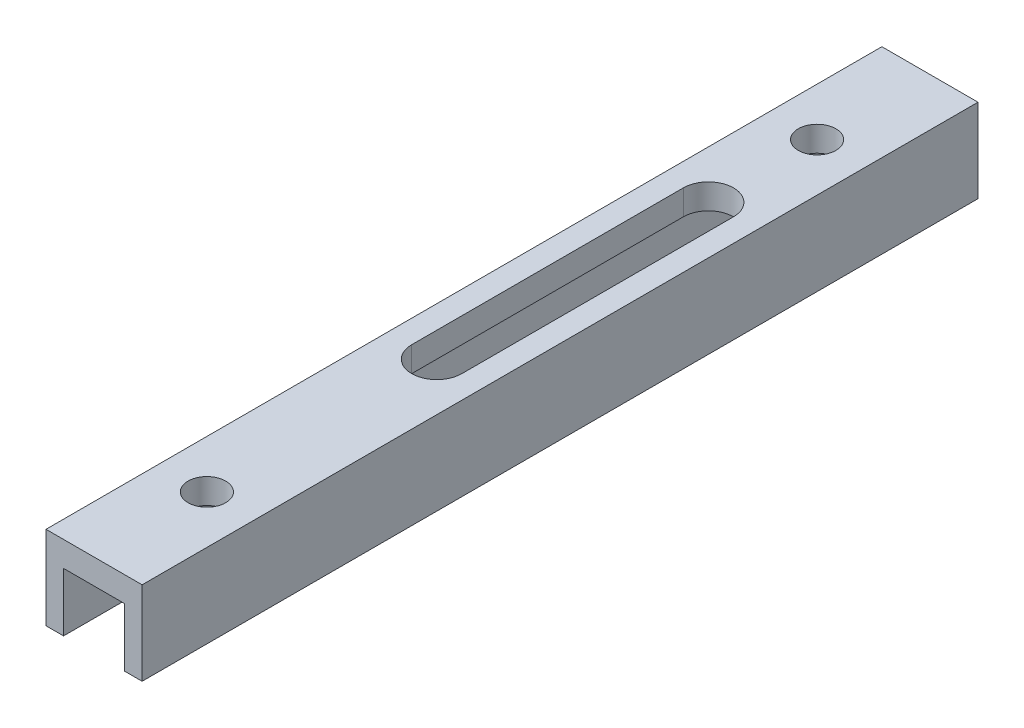
ISO-10303-21;
HEADER;
FILE_DESCRIPTION(('STEP AP214'),'2;1');
FILE_NAME('part.step','',(''),(''),'','','');
FILE_SCHEMA(('AUTOMOTIVE_DESIGN { 1 0 10303 214 1 1 1 1 }'));
ENDSEC;
DATA;
#1=APPLICATION_CONTEXT('core data for automotive mechanical design processes');
#2=APPLICATION_PROTOCOL_DEFINITION('international standard','automotive_design',2000,#1);
#3=PRODUCT_CONTEXT('',#1,'mechanical');
#4=PRODUCT('Part','Part','',(#3));
#5=PRODUCT_RELATED_PRODUCT_CATEGORY('part','',(#4));
#6=PRODUCT_DEFINITION_FORMATION('','',#4);
#7=PRODUCT_DEFINITION_CONTEXT('part definition',#1,'design');
#8=PRODUCT_DEFINITION('design','',#6,#7);
#9=PRODUCT_DEFINITION_SHAPE('','',#8);
#10=(LENGTH_UNIT() NAMED_UNIT(*) SI_UNIT(.MILLI.,.METRE.));
#11=(NAMED_UNIT(*) PLANE_ANGLE_UNIT() SI_UNIT($,.RADIAN.));
#12=(NAMED_UNIT(*) SI_UNIT($,.STERADIAN.) SOLID_ANGLE_UNIT());
#13=UNCERTAINTY_MEASURE_WITH_UNIT(LENGTH_MEASURE(1.E-05),#10,'distance_accuracy_value','');
#14=(GEOMETRIC_REPRESENTATION_CONTEXT(3) GLOBAL_UNCERTAINTY_ASSIGNED_CONTEXT((#13)) GLOBAL_UNIT_ASSIGNED_CONTEXT((#10,
#11,#12)) REPRESENTATION_CONTEXT('',''));
#15=CARTESIAN_POINT('',(0.,0.,0.));
#16=DIRECTION('',(0.,0.,1.));
#17=DIRECTION('',(1.,0.,0.));
#18=AXIS2_PLACEMENT_3D('',#15,#16,#17);
#19=CARTESIAN_POINT('',(-5.75,-10.,-100.));
#20=DIRECTION('',(-1.,0.,0.));
#21=DIRECTION('',(0.,0.,1.));
#22=AXIS2_PLACEMENT_3D('',#19,#20,#21);
#23=PLANE('',#22);
#24=DIRECTION('',(0.,-1.,0.));
#25=VECTOR('',#24,1.);
#26=CARTESIAN_POINT('',(-5.75,-10.,0.));
#27=LINE('',#26,#25);
#28=CARTESIAN_POINT('',(-5.75,0.,0.));
#29=VERTEX_POINT('',#28);
#30=CARTESIAN_POINT('',(-5.75,-10.,0.));
#31=VERTEX_POINT('',#30);
#32=EDGE_CURVE('E193',#29,#31,#27,.T.);
#33=ORIENTED_EDGE('',*,*,#32,.F.);
#34=DIRECTION('',(0.,0.,1.));
#35=VECTOR('',#34,1.);
#36=CARTESIAN_POINT('',(-5.75,0.,-100.));
#37=LINE('',#36,#35);
#38=CARTESIAN_POINT('',(-5.75,0.,-100.));
#39=VERTEX_POINT('',#38);
#40=EDGE_CURVE('E216',#39,#29,#37,.T.);
#41=ORIENTED_EDGE('',*,*,#40,.F.);
#42=DIRECTION('',(0.,-1.,0.));
#43=VECTOR('',#42,1.);
#44=CARTESIAN_POINT('',(-5.75,-10.,-100.));
#45=LINE('',#44,#43);
#46=CARTESIAN_POINT('',(-5.75,-10.,-100.));
#47=VERTEX_POINT('',#46);
#48=EDGE_CURVE('E167',#39,#47,#45,.T.);
#49=ORIENTED_EDGE('',*,*,#48,.T.);
#50=DIRECTION('',(0.,0.,1.));
#51=VECTOR('',#50,1.);
#52=CARTESIAN_POINT('',(-5.75,-10.,-100.));
#53=LINE('',#52,#51);
#54=EDGE_CURVE('E192',#47,#31,#53,.T.);
#55=ORIENTED_EDGE('',*,*,#54,.T.);
#56=EDGE_LOOP('',(#33,#41,#49,#55));
#57=FACE_BOUND('',#56,.T.);
#58=ADVANCED_FACE('F44',(#57),#23,.T.);
#59=CARTESIAN_POINT('',(-5.75,0.,-100.));
#60=DIRECTION('',(0.,1.,0.));
#61=DIRECTION('',(0.,0.,1.));
#62=AXIS2_PLACEMENT_3D('',#59,#60,#61);
#63=PLANE('',#62);
#64=CARTESIAN_POINT('',(0.,0.,-73.5));
#65=DIRECTION('',(0.,1.,0.));
#66=DIRECTION('',(0.,0.,-1.));
#67=AXIS2_PLACEMENT_3D('',#64,#65,#66);
#68=CIRCLE('',#67,3.);
#69=CARTESIAN_POINT('',(3.,0.,-73.5));
#70=VERTEX_POINT('',#69);
#71=CARTESIAN_POINT('',(-3.,0.,-73.5));
#72=VERTEX_POINT('',#71);
#73=EDGE_CURVE('E58',#70,#72,#68,.T.);
#74=ORIENTED_EDGE('',*,*,#73,.F.);
#75=DIRECTION('',(0.,0.,-1.));
#76=VECTOR('',#75,1.);
#77=CARTESIAN_POINT('',(3.,0.,-73.5));
#78=LINE('',#77,#76);
#79=CARTESIAN_POINT('',(3.,0.,-41.));
#80=VERTEX_POINT('',#79);
#81=EDGE_CURVE('E150',#80,#70,#78,.T.);
#82=ORIENTED_EDGE('',*,*,#81,.F.);
#83=CARTESIAN_POINT('',(0.,0.,-41.));
#84=DIRECTION('',(0.,1.,0.));
#85=DIRECTION('',(0.,0.,-1.));
#86=AXIS2_PLACEMENT_3D('',#83,#84,#85);
#87=CIRCLE('',#86,3.);
#88=CARTESIAN_POINT('',(-3.,0.,-41.));
#89=VERTEX_POINT('',#88);
#90=EDGE_CURVE('E134',#89,#80,#87,.T.);
#91=ORIENTED_EDGE('',*,*,#90,.F.);
#92=DIRECTION('',(0.,0.,1.));
#93=VECTOR('',#92,1.);
#94=CARTESIAN_POINT('',(-3.,0.,-73.5));
#95=LINE('',#94,#93);
#96=EDGE_CURVE('E143',#72,#89,#95,.T.);
#97=ORIENTED_EDGE('',*,*,#96,.F.);
#98=EDGE_LOOP('',(#74,#82,#91,#97));
#99=FACE_BOUND('',#98,.T.);
#100=CARTESIAN_POINT('',(0.,0.,-13.5));
#101=DIRECTION('',(0.,1.,0.));
#102=DIRECTION('',(0.,0.,1.));
#103=AXIS2_PLACEMENT_3D('',#100,#101,#102);
#104=CIRCLE('',#103,2.25);
#105=CARTESIAN_POINT('',(0.,0.,-11.25));
#106=VERTEX_POINT('',#105);
#107=EDGE_CURVE('E157',#106,#106,#104,.T.);
#108=ORIENTED_EDGE('',*,*,#107,.F.);
#109=EDGE_LOOP('',(#108));
#110=FACE_BOUND('',#109,.T.);
#111=CARTESIAN_POINT('',(0.,0.,-86.5));
#112=DIRECTION('',(0.,1.,0.));
#113=DIRECTION('',(0.,0.,1.));
#114=AXIS2_PLACEMENT_3D('',#111,#112,#113);
#115=CIRCLE('',#114,2.25);
#116=CARTESIAN_POINT('',(0.,0.,-84.25));
#117=VERTEX_POINT('',#116);
#118=EDGE_CURVE('E163',#117,#117,#115,.T.);
#119=ORIENTED_EDGE('',*,*,#118,.F.);
#120=EDGE_LOOP('',(#119));
#121=FACE_BOUND('',#120,.T.);
#122=DIRECTION('',(-1.,0.,0.));
#123=VECTOR('',#122,1.);
#124=CARTESIAN_POINT('',(-5.75,0.,0.));
#125=LINE('',#124,#123);
#126=CARTESIAN_POINT('',(5.75,0.,0.));
#127=VERTEX_POINT('',#126);
#128=EDGE_CURVE('E171',#127,#29,#125,.T.);
#129=ORIENTED_EDGE('',*,*,#128,.F.);
#130=DIRECTION('',(0.,0.,1.));
#131=VECTOR('',#130,1.);
#132=CARTESIAN_POINT('',(5.75,0.,-100.));
#133=LINE('',#132,#131);
#134=CARTESIAN_POINT('',(5.75,0.,-100.));
#135=VERTEX_POINT('',#134);
#136=EDGE_CURVE('E219',#135,#127,#133,.T.);
#137=ORIENTED_EDGE('',*,*,#136,.F.);
#138=DIRECTION('',(-1.,0.,0.));
#139=VECTOR('',#138,1.);
#140=CARTESIAN_POINT('',(-5.75,0.,-100.));
#141=LINE('',#140,#139);
#142=EDGE_CURVE('E189',#135,#39,#141,.T.);
#143=ORIENTED_EDGE('',*,*,#142,.T.);
#144=ORIENTED_EDGE('',*,*,#40,.T.);
#145=EDGE_LOOP('',(#129,#137,#143,#144));
#146=FACE_BOUND('',#145,.T.);
#147=ADVANCED_FACE('F147',(#99,#110,#121,#146),#63,.T.);
#148=CARTESIAN_POINT('',(5.75,0.,-100.));
#149=DIRECTION('',(1.,0.,0.));
#150=DIRECTION('',(0.,0.,-1.));
#151=AXIS2_PLACEMENT_3D('',#148,#149,#150);
#152=PLANE('',#151);
#153=DIRECTION('',(0.,1.,0.));
#154=VECTOR('',#153,1.);
#155=CARTESIAN_POINT('',(5.75,0.,0.));
#156=LINE('',#155,#154);
#157=CARTESIAN_POINT('',(5.75,-10.,0.));
#158=VERTEX_POINT('',#157);
#159=EDGE_CURVE('E211',#158,#127,#156,.T.);
#160=ORIENTED_EDGE('',*,*,#159,.F.);
#161=DIRECTION('',(0.,0.,1.));
#162=VECTOR('',#161,1.);
#163=CARTESIAN_POINT('',(5.75,-10.,-100.));
#164=LINE('',#163,#162);
#165=CARTESIAN_POINT('',(5.75,-10.,-100.));
#166=VERTEX_POINT('',#165);
#167=EDGE_CURVE('E221',#166,#158,#164,.T.);
#168=ORIENTED_EDGE('',*,*,#167,.F.);
#169=DIRECTION('',(0.,1.,0.));
#170=VECTOR('',#169,1.);
#171=CARTESIAN_POINT('',(5.75,0.,-100.));
#172=LINE('',#171,#170);
#173=EDGE_CURVE('E186',#166,#135,#172,.T.);
#174=ORIENTED_EDGE('',*,*,#173,.T.);
#175=ORIENTED_EDGE('',*,*,#136,.T.);
#176=EDGE_LOOP('',(#160,#168,#174,#175));
#177=FACE_BOUND('',#176,.T.);
#178=ADVANCED_FACE('F263',(#177),#152,.T.);
#179=CARTESIAN_POINT('',(5.75,-10.,-100.));
#180=DIRECTION('',(0.,-1.,0.));
#181=DIRECTION('',(1.,0.,0.));
#182=AXIS2_PLACEMENT_3D('',#179,#180,#181);
#183=PLANE('',#182);
#184=DIRECTION('',(1.,0.,0.));
#185=VECTOR('',#184,1.);
#186=CARTESIAN_POINT('',(5.75,-10.,0.));
#187=LINE('',#186,#185);
#188=CARTESIAN_POINT('',(3.65,-10.,0.));
#189=VERTEX_POINT('',#188);
#190=EDGE_CURVE('E208',#189,#158,#187,.T.);
#191=ORIENTED_EDGE('',*,*,#190,.F.);
#192=DIRECTION('',(0.,0.,1.));
#193=VECTOR('',#192,1.);
#194=CARTESIAN_POINT('',(3.65,-10.,-100.));
#195=LINE('',#194,#193);
#196=CARTESIAN_POINT('',(3.65,-10.,-100.));
#197=VERTEX_POINT('',#196);
#198=EDGE_CURVE('E223',#197,#189,#195,.T.);
#199=ORIENTED_EDGE('',*,*,#198,.F.);
#200=DIRECTION('',(1.,0.,0.));
#201=VECTOR('',#200,1.);
#202=CARTESIAN_POINT('',(5.75,-10.,-100.));
#203=LINE('',#202,#201);
#204=EDGE_CURVE('E183',#197,#166,#203,.T.);
#205=ORIENTED_EDGE('',*,*,#204,.T.);
#206=ORIENTED_EDGE('',*,*,#167,.T.);
#207=EDGE_LOOP('',(#191,#199,#205,#206));
#208=FACE_BOUND('',#207,.T.);
#209=ADVANCED_FACE('F294',(#208),#183,.T.);
#210=CARTESIAN_POINT('',(3.65,-10.,-100.));
#211=DIRECTION('',(-1.,0.,0.));
#212=DIRECTION('',(0.,-1.,0.));
#213=AXIS2_PLACEMENT_3D('',#210,#211,#212);
#214=PLANE('',#213);
#215=DIRECTION('',(0.,-1.,0.));
#216=VECTOR('',#215,1.);
#217=CARTESIAN_POINT('',(3.65,-10.,0.));
#218=LINE('',#217,#216);
#219=CARTESIAN_POINT('',(3.65,-3.,0.));
#220=VERTEX_POINT('',#219);
#221=EDGE_CURVE('E205',#220,#189,#218,.T.);
#222=ORIENTED_EDGE('',*,*,#221,.F.);
#223=DIRECTION('',(0.,0.,1.));
#224=VECTOR('',#223,1.);
#225=CARTESIAN_POINT('',(3.65,-3.,-100.));
#226=LINE('',#225,#224);
#227=CARTESIAN_POINT('',(3.65,-3.,-100.));
#228=VERTEX_POINT('',#227);
#229=EDGE_CURVE('E225',#228,#220,#226,.T.);
#230=ORIENTED_EDGE('',*,*,#229,.F.);
#231=DIRECTION('',(0.,-1.,0.));
#232=VECTOR('',#231,1.);
#233=CARTESIAN_POINT('',(3.65,-10.,-100.));
#234=LINE('',#233,#232);
#235=EDGE_CURVE('E180',#228,#197,#234,.T.);
#236=ORIENTED_EDGE('',*,*,#235,.T.);
#237=ORIENTED_EDGE('',*,*,#198,.T.);
#238=EDGE_LOOP('',(#222,#230,#236,#237));
#239=FACE_BOUND('',#238,.T.);
#240=ADVANCED_FACE('F291',(#239),#214,.T.);
#241=CARTESIAN_POINT('',(3.65,-3.,-100.));
#242=DIRECTION('',(0.,-1.,0.));
#243=DIRECTION('',(1.,0.,0.));
#244=AXIS2_PLACEMENT_3D('',#241,#242,#243);
#245=PLANE('',#244);
#246=CARTESIAN_POINT('',(0.,-3.,-73.5));
#247=DIRECTION('',(0.,-1.,0.));
#248=DIRECTION('',(1.,0.,0.));
#249=AXIS2_PLACEMENT_3D('',#246,#247,#248);
#250=CIRCLE('',#249,3.);
#251=CARTESIAN_POINT('',(-3.,-3.,-73.5));
#252=VERTEX_POINT('',#251);
#253=CARTESIAN_POINT('',(3.,-3.,-73.5));
#254=VERTEX_POINT('',#253);
#255=EDGE_CURVE('E13',#252,#254,#250,.T.);
#256=ORIENTED_EDGE('',*,*,#255,.F.);
#257=DIRECTION('',(0.,0.,-1.));
#258=VECTOR('',#257,1.);
#259=CARTESIAN_POINT('',(-3.,-3.,-100.));
#260=LINE('',#259,#258);
#261=CARTESIAN_POINT('',(-3.,-3.,-41.));
#262=VERTEX_POINT('',#261);
#263=EDGE_CURVE('E218',#262,#252,#260,.T.);
#264=ORIENTED_EDGE('',*,*,#263,.F.);
#265=CARTESIAN_POINT('',(0.,-3.,-41.));
#266=DIRECTION('',(0.,-1.,0.));
#267=DIRECTION('',(1.,0.,0.));
#268=AXIS2_PLACEMENT_3D('',#265,#266,#267);
#269=CIRCLE('',#268,3.);
#270=CARTESIAN_POINT('',(3.,-3.,-41.));
#271=VERTEX_POINT('',#270);
#272=EDGE_CURVE('E137',#271,#262,#269,.T.);
#273=ORIENTED_EDGE('',*,*,#272,.F.);
#274=DIRECTION('',(0.,0.,1.));
#275=VECTOR('',#274,1.);
#276=CARTESIAN_POINT('',(3.,-3.,-100.));
#277=LINE('',#276,#275);
#278=EDGE_CURVE('E51',#254,#271,#277,.T.);
#279=ORIENTED_EDGE('',*,*,#278,.F.);
#280=EDGE_LOOP('',(#256,#264,#273,#279));
#281=FACE_BOUND('',#280,.T.);
#282=CARTESIAN_POINT('',(0.,-3.,-13.5));
#283=DIRECTION('',(0.,-1.,0.));
#284=DIRECTION('',(1.,0.,0.));
#285=AXIS2_PLACEMENT_3D('',#282,#283,#284);
#286=CIRCLE('',#285,2.25);
#287=CARTESIAN_POINT('',(2.25,-3.,-13.5));
#288=VERTEX_POINT('',#287);
#289=EDGE_CURVE('E162',#288,#288,#286,.T.);
#290=ORIENTED_EDGE('',*,*,#289,.F.);
#291=EDGE_LOOP('',(#290));
#292=FACE_BOUND('',#291,.T.);
#293=CARTESIAN_POINT('',(0.,-3.,-86.5));
#294=DIRECTION('',(0.,-1.,0.));
#295=DIRECTION('',(1.,0.,0.));
#296=AXIS2_PLACEMENT_3D('',#293,#294,#295);
#297=CIRCLE('',#296,2.25);
#298=CARTESIAN_POINT('',(2.25,-3.,-86.5));
#299=VERTEX_POINT('',#298);
#300=EDGE_CURVE('E166',#299,#299,#297,.T.);
#301=ORIENTED_EDGE('',*,*,#300,.F.);
#302=EDGE_LOOP('',(#301));
#303=FACE_BOUND('',#302,.T.);
#304=DIRECTION('',(1.,0.,0.));
#305=VECTOR('',#304,1.);
#306=CARTESIAN_POINT('',(3.65,-3.,0.));
#307=LINE('',#306,#305);
#308=CARTESIAN_POINT('',(-3.65,-3.,0.));
#309=VERTEX_POINT('',#308);
#310=EDGE_CURVE('E202',#309,#220,#307,.T.);
#311=ORIENTED_EDGE('',*,*,#310,.F.);
#312=DIRECTION('',(0.,0.,1.));
#313=VECTOR('',#312,1.);
#314=CARTESIAN_POINT('',(-3.65,-3.,-100.));
#315=LINE('',#314,#313);
#316=CARTESIAN_POINT('',(-3.65,-3.,-100.));
#317=VERTEX_POINT('',#316);
#318=EDGE_CURVE('E227',#317,#309,#315,.T.);
#319=ORIENTED_EDGE('',*,*,#318,.F.);
#320=DIRECTION('',(1.,0.,0.));
#321=VECTOR('',#320,1.);
#322=CARTESIAN_POINT('',(3.65,-3.,-100.));
#323=LINE('',#322,#321);
#324=EDGE_CURVE('E177',#317,#228,#323,.T.);
#325=ORIENTED_EDGE('',*,*,#324,.T.);
#326=ORIENTED_EDGE('',*,*,#229,.T.);
#327=EDGE_LOOP('',(#311,#319,#325,#326));
#328=FACE_BOUND('',#327,.T.);
#329=ADVANCED_FACE('F243',(#281,#292,#303,#328),#245,.T.);
#330=CARTESIAN_POINT('',(-3.65,-3.,-100.));
#331=DIRECTION('',(1.,0.,0.));
#332=DIRECTION('',(0.,1.,0.));
#333=AXIS2_PLACEMENT_3D('',#330,#331,#332);
#334=PLANE('',#333);
#335=DIRECTION('',(0.,1.,0.));
#336=VECTOR('',#335,1.);
#337=CARTESIAN_POINT('',(-3.65,-3.,0.));
#338=LINE('',#337,#336);
#339=CARTESIAN_POINT('',(-3.65,-10.,0.));
#340=VERTEX_POINT('',#339);
#341=EDGE_CURVE('E199',#340,#309,#338,.T.);
#342=ORIENTED_EDGE('',*,*,#341,.F.);
#343=DIRECTION('',(0.,0.,1.));
#344=VECTOR('',#343,1.);
#345=CARTESIAN_POINT('',(-3.65,-10.,-100.));
#346=LINE('',#345,#344);
#347=CARTESIAN_POINT('',(-3.65,-10.,-100.));
#348=VERTEX_POINT('',#347);
#349=EDGE_CURVE('E229',#348,#340,#346,.T.);
#350=ORIENTED_EDGE('',*,*,#349,.F.);
#351=DIRECTION('',(0.,1.,0.));
#352=VECTOR('',#351,1.);
#353=CARTESIAN_POINT('',(-3.65,-3.,-100.));
#354=LINE('',#353,#352);
#355=EDGE_CURVE('E174',#348,#317,#354,.T.);
#356=ORIENTED_EDGE('',*,*,#355,.T.);
#357=ORIENTED_EDGE('',*,*,#318,.T.);
#358=EDGE_LOOP('',(#342,#350,#356,#357));
#359=FACE_BOUND('',#358,.T.);
#360=ADVANCED_FACE('F286',(#359),#334,.T.);
#361=CARTESIAN_POINT('',(-3.65,-10.,-100.));
#362=DIRECTION('',(0.,-1.,0.));
#363=DIRECTION('',(1.,0.,0.));
#364=AXIS2_PLACEMENT_3D('',#361,#362,#363);
#365=PLANE('',#364);
#366=DIRECTION('',(1.,0.,0.));
#367=VECTOR('',#366,1.);
#368=CARTESIAN_POINT('',(-3.65,-10.,0.));
#369=LINE('',#368,#367);
#370=EDGE_CURVE('E196',#31,#340,#369,.T.);
#371=ORIENTED_EDGE('',*,*,#370,.F.);
#372=ORIENTED_EDGE('',*,*,#54,.F.);
#373=DIRECTION('',(1.,0.,0.));
#374=VECTOR('',#373,1.);
#375=CARTESIAN_POINT('',(-3.65,-10.,-100.));
#376=LINE('',#375,#374);
#377=EDGE_CURVE('E170',#47,#348,#376,.T.);
#378=ORIENTED_EDGE('',*,*,#377,.T.);
#379=ORIENTED_EDGE('',*,*,#349,.T.);
#380=EDGE_LOOP('',(#371,#372,#378,#379));
#381=FACE_BOUND('',#380,.T.);
#382=ADVANCED_FACE('F282',(#381),#365,.T.);
#383=CARTESIAN_POINT('',(0.,0.,-100.));
#384=DIRECTION('',(0.,0.,-1.));
#385=DIRECTION('',(-1.,0.,0.));
#386=AXIS2_PLACEMENT_3D('',#383,#384,#385);
#387=PLANE('',#386);
#388=ORIENTED_EDGE('',*,*,#48,.F.);
#389=ORIENTED_EDGE('',*,*,#142,.F.);
#390=ORIENTED_EDGE('',*,*,#173,.F.);
#391=ORIENTED_EDGE('',*,*,#204,.F.);
#392=ORIENTED_EDGE('',*,*,#235,.F.);
#393=ORIENTED_EDGE('',*,*,#324,.F.);
#394=ORIENTED_EDGE('',*,*,#355,.F.);
#395=ORIENTED_EDGE('',*,*,#377,.F.);
#396=EDGE_LOOP('',(#388,#389,#390,#391,#392,#393,#394,#395));
#397=FACE_BOUND('',#396,.T.);
#398=ADVANCED_FACE('F276',(#397),#387,.T.);
#399=CARTESIAN_POINT('',(0.,0.,0.));
#400=DIRECTION('',(0.,0.,-1.));
#401=DIRECTION('',(-1.,0.,0.));
#402=AXIS2_PLACEMENT_3D('',#399,#400,#401);
#403=PLANE('',#402);
#404=ORIENTED_EDGE('',*,*,#32,.T.);
#405=ORIENTED_EDGE('',*,*,#370,.T.);
#406=ORIENTED_EDGE('',*,*,#341,.T.);
#407=ORIENTED_EDGE('',*,*,#310,.T.);
#408=ORIENTED_EDGE('',*,*,#221,.T.);
#409=ORIENTED_EDGE('',*,*,#190,.T.);
#410=ORIENTED_EDGE('',*,*,#159,.T.);
#411=ORIENTED_EDGE('',*,*,#128,.T.);
#412=EDGE_LOOP('',(#404,#405,#406,#407,#408,#409,#410,#411));
#413=FACE_BOUND('',#412,.T.);
#414=ADVANCED_FACE('F270',(#413),#403,.F.);
#415=CARTESIAN_POINT('',(0.,-10.,-86.5));
#416=DIRECTION('',(0.,1.,0.));
#417=DIRECTION('',(0.,0.,1.));
#418=AXIS2_PLACEMENT_3D('',#415,#416,#417);
#419=CYLINDRICAL_SURFACE('',#418,2.25);
#420=ORIENTED_EDGE('',*,*,#300,.T.);
#421=EDGE_LOOP('',(#420));
#422=FACE_BOUND('',#421,.T.);
#423=ORIENTED_EDGE('',*,*,#118,.T.);
#424=EDGE_LOOP('',(#423));
#425=FACE_BOUND('',#424,.T.);
#426=ADVANCED_FACE('F254',(#422,#425),#419,.F.);
#427=CARTESIAN_POINT('',(0.,-10.,-13.5));
#428=DIRECTION('',(0.,1.,0.));
#429=DIRECTION('',(0.,0.,1.));
#430=AXIS2_PLACEMENT_3D('',#427,#428,#429);
#431=CYLINDRICAL_SURFACE('',#430,2.25);
#432=ORIENTED_EDGE('',*,*,#289,.T.);
#433=EDGE_LOOP('',(#432));
#434=FACE_BOUND('',#433,.T.);
#435=ORIENTED_EDGE('',*,*,#107,.T.);
#436=EDGE_LOOP('',(#435));
#437=FACE_BOUND('',#436,.T.);
#438=ADVANCED_FACE('F247',(#434,#437),#431,.F.);
#439=CARTESIAN_POINT('',(0.,-10.,-73.5));
#440=DIRECTION('',(0.,1.,0.));
#441=DIRECTION('',(0.,0.,1.));
#442=AXIS2_PLACEMENT_3D('',#439,#440,#441);
#443=CYLINDRICAL_SURFACE('',#442,3.);
#444=ORIENTED_EDGE('',*,*,#255,.T.);
#445=DIRECTION('',(0.,1.,0.));
#446=VECTOR('',#445,1.);
#447=CARTESIAN_POINT('',(3.,-10.,-73.5));
#448=LINE('',#447,#446);
#449=EDGE_CURVE('E155',#254,#70,#448,.T.);
#450=ORIENTED_EDGE('',*,*,#449,.T.);
#451=ORIENTED_EDGE('',*,*,#73,.T.);
#452=DIRECTION('',(0.,1.,0.));
#453=VECTOR('',#452,1.);
#454=CARTESIAN_POINT('',(-3.,-10.,-73.5));
#455=LINE('',#454,#453);
#456=EDGE_CURVE('E140',#252,#72,#455,.T.);
#457=ORIENTED_EDGE('',*,*,#456,.F.);
#458=EDGE_LOOP('',(#444,#450,#451,#457));
#459=FACE_BOUND('',#458,.T.);
#460=ADVANCED_FACE('F245',(#459),#443,.F.);
#461=CARTESIAN_POINT('',(3.,-10.,-73.5));
#462=DIRECTION('',(1.,0.,0.));
#463=DIRECTION('',(0.,0.,-1.));
#464=AXIS2_PLACEMENT_3D('',#461,#462,#463);
#465=PLANE('',#464);
#466=ORIENTED_EDGE('',*,*,#278,.T.);
#467=DIRECTION('',(0.,1.,0.));
#468=VECTOR('',#467,1.);
#469=CARTESIAN_POINT('',(3.,-10.,-41.));
#470=LINE('',#469,#468);
#471=EDGE_CURVE('E139',#271,#80,#470,.T.);
#472=ORIENTED_EDGE('',*,*,#471,.T.);
#473=ORIENTED_EDGE('',*,*,#81,.T.);
#474=ORIENTED_EDGE('',*,*,#449,.F.);
#475=EDGE_LOOP('',(#466,#472,#473,#474));
#476=FACE_BOUND('',#475,.T.);
#477=ADVANCED_FACE('F240',(#476),#465,.F.);
#478=CARTESIAN_POINT('',(0.,-10.,-41.));
#479=DIRECTION('',(0.,1.,0.));
#480=DIRECTION('',(0.,0.,1.));
#481=AXIS2_PLACEMENT_3D('',#478,#479,#480);
#482=CYLINDRICAL_SURFACE('',#481,3.);
#483=ORIENTED_EDGE('',*,*,#272,.T.);
#484=DIRECTION('',(0.,1.,0.));
#485=VECTOR('',#484,1.);
#486=CARTESIAN_POINT('',(-3.,-10.,-41.));
#487=LINE('',#486,#485);
#488=EDGE_CURVE('E66',#262,#89,#487,.T.);
#489=ORIENTED_EDGE('',*,*,#488,.T.);
#490=ORIENTED_EDGE('',*,*,#90,.T.);
#491=ORIENTED_EDGE('',*,*,#471,.F.);
#492=EDGE_LOOP('',(#483,#489,#490,#491));
#493=FACE_BOUND('',#492,.T.);
#494=ADVANCED_FACE('F131',(#493),#482,.F.);
#495=CARTESIAN_POINT('',(-3.,-10.,-73.5));
#496=DIRECTION('',(-1.,0.,0.));
#497=DIRECTION('',(0.,0.,1.));
#498=AXIS2_PLACEMENT_3D('',#495,#496,#497);
#499=PLANE('',#498);
#500=ORIENTED_EDGE('',*,*,#263,.T.);
#501=ORIENTED_EDGE('',*,*,#456,.T.);
#502=ORIENTED_EDGE('',*,*,#96,.T.);
#503=ORIENTED_EDGE('',*,*,#488,.F.);
#504=EDGE_LOOP('',(#500,#501,#502,#503));
#505=FACE_BOUND('',#504,.T.);
#506=ADVANCED_FACE('F144',(#505),#499,.F.);
#507=CLOSED_SHELL('',(#58,#147,#178,#209,#240,#329,#360,#382,#398,#414,#426,#438,#460,#477,#494,#506));
#508=MANIFOLD_SOLID_BREP('B2',#507);
#509=ADVANCED_BREP_SHAPE_REPRESENTATION('',(#18,#508),#14);
#510=SHAPE_DEFINITION_REPRESENTATION(#9,#509);
ENDSEC;
END-ISO-10303-21;
